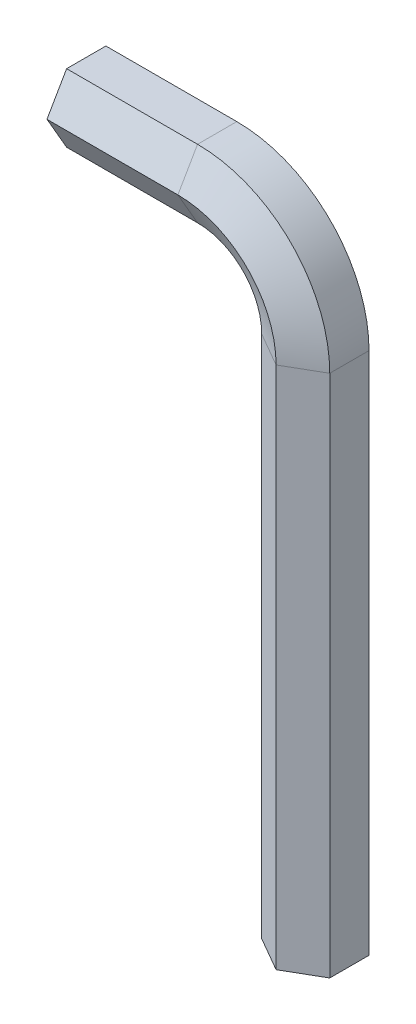
ISO-10303-21;
HEADER;
FILE_DESCRIPTION(('STEP AP214'),'2;1');
FILE_NAME('part.step','',(''),(''),'','','');
FILE_SCHEMA(('AUTOMOTIVE_DESIGN { 1 0 10303 214 1 1 1 1 }'));
ENDSEC;
DATA;
#1=APPLICATION_CONTEXT('core data for automotive mechanical design processes');
#2=APPLICATION_PROTOCOL_DEFINITION('international standard','automotive_design',2000,#1);
#3=PRODUCT_CONTEXT('',#1,'mechanical');
#4=PRODUCT('Part','Part','',(#3));
#5=PRODUCT_RELATED_PRODUCT_CATEGORY('part','',(#4));
#6=PRODUCT_DEFINITION_FORMATION('','',#4);
#7=PRODUCT_DEFINITION_CONTEXT('part definition',#1,'design');
#8=PRODUCT_DEFINITION('design','',#6,#7);
#9=PRODUCT_DEFINITION_SHAPE('','',#8);
#10=(LENGTH_UNIT() NAMED_UNIT(*) SI_UNIT(.MILLI.,.METRE.));
#11=(NAMED_UNIT(*) PLANE_ANGLE_UNIT() SI_UNIT($,.RADIAN.));
#12=(NAMED_UNIT(*) SI_UNIT($,.STERADIAN.) SOLID_ANGLE_UNIT());
#13=UNCERTAINTY_MEASURE_WITH_UNIT(LENGTH_MEASURE(1.E-05),#10,'distance_accuracy_value','');
#14=(GEOMETRIC_REPRESENTATION_CONTEXT(3) GLOBAL_UNCERTAINTY_ASSIGNED_CONTEXT((#13)) GLOBAL_UNIT_ASSIGNED_CONTEXT((#10,
#11,#12)) REPRESENTATION_CONTEXT('',''));
#15=CARTESIAN_POINT('',(0.,0.,0.));
#16=DIRECTION('',(0.,0.,1.));
#17=DIRECTION('',(1.,0.,0.));
#18=AXIS2_PLACEMENT_3D('',#15,#16,#17);
#19=CARTESIAN_POINT('',(-95.,0.,0.));
#20=DIRECTION('',(0.,1.,0.));
#21=DIRECTION('',(0.,0.,1.));
#22=AXIS2_PLACEMENT_3D('',#19,#20,#21);
#23=PLANE('',#22);
#24=DIRECTION('',(0.866025403784439,0.,0.5));
#25=VECTOR('',#24,1.);
#26=CARTESIAN_POINT('',(-5.19615242270663,0.,3.));
#27=LINE('',#26,#25);
#28=CARTESIAN_POINT('',(-5.19615242270663,0.,3.));
#29=VERTEX_POINT('',#28);
#30=CARTESIAN_POINT('',(0.,0.,6.));
#31=VERTEX_POINT('',#30);
#32=EDGE_CURVE('E194',#29,#31,#27,.T.);
#33=ORIENTED_EDGE('',*,*,#32,.F.);
#34=DIRECTION('',(0.,0.,1.));
#35=VECTOR('',#34,1.);
#36=CARTESIAN_POINT('',(-5.19615242270663,0.,-3.));
#37=LINE('',#36,#35);
#38=CARTESIAN_POINT('',(-5.19615242270663,0.,-3.));
#39=VERTEX_POINT('',#38);
#40=EDGE_CURVE('E256',#39,#29,#37,.T.);
#41=ORIENTED_EDGE('',*,*,#40,.F.);
#42=DIRECTION('',(-0.866025403784438,0.,0.5));
#43=VECTOR('',#42,1.);
#44=CARTESIAN_POINT('',(0.,0.,-6.));
#45=LINE('',#44,#43);
#46=CARTESIAN_POINT('',(0.,0.,-6.));
#47=VERTEX_POINT('',#46);
#48=EDGE_CURVE('E236',#47,#39,#45,.T.);
#49=ORIENTED_EDGE('',*,*,#48,.F.);
#50=DIRECTION('',(-0.866025403784438,0.,-0.5));
#51=VECTOR('',#50,1.);
#52=CARTESIAN_POINT('',(5.19615242270663,0.,-3.));
#53=LINE('',#52,#51);
#54=CARTESIAN_POINT('',(5.19615242270663,0.,-3.));
#55=VERTEX_POINT('',#54);
#56=EDGE_CURVE('E141',#55,#47,#53,.T.);
#57=ORIENTED_EDGE('',*,*,#56,.F.);
#58=DIRECTION('',(0.,0.,-1.));
#59=VECTOR('',#58,1.);
#60=CARTESIAN_POINT('',(5.19615242270663,0.,3.));
#61=LINE('',#60,#59);
#62=CARTESIAN_POINT('',(5.19615242270663,0.,3.));
#63=VERTEX_POINT('',#62);
#64=EDGE_CURVE('E145',#63,#55,#61,.T.);
#65=ORIENTED_EDGE('',*,*,#64,.F.);
#66=DIRECTION('',(0.866025403784439,0.,-0.5));
#67=VECTOR('',#66,1.);
#68=CARTESIAN_POINT('',(0.,0.,6.));
#69=LINE('',#68,#67);
#70=EDGE_CURVE('E150',#31,#63,#69,.T.);
#71=ORIENTED_EDGE('',*,*,#70,.F.);
#72=EDGE_LOOP('',(#33,#41,#49,#57,#65,#71));
#73=FACE_BOUND('',#72,.T.);
#74=ADVANCED_FACE('F39',(#73),#23,.F.);
#75=CARTESIAN_POINT('',(-35.,0.,0.));
#76=DIRECTION('',(-1.,0.,0.));
#77=DIRECTION('',(0.,0.,1.));
#78=AXIS2_PLACEMENT_3D('',#75,#76,#77);
#79=PLANE('',#78);
#80=DIRECTION('',(0.,0.866025403784439,0.5));
#81=VECTOR('',#80,1.);
#82=CARTESIAN_POINT('',(-35.,89.8038475772934,3.));
#83=LINE('',#82,#81);
#84=CARTESIAN_POINT('',(-35.,89.8038475772934,3.));
#85=VERTEX_POINT('',#84);
#86=CARTESIAN_POINT('',(-35.,95.,6.));
#87=VERTEX_POINT('',#86);
#88=EDGE_CURVE('E161',#85,#87,#83,.T.);
#89=ORIENTED_EDGE('',*,*,#88,.T.);
#90=DIRECTION('',(0.,0.866025403784439,-0.5));
#91=VECTOR('',#90,1.);
#92=CARTESIAN_POINT('',(-35.,95.,6.));
#93=LINE('',#92,#91);
#94=CARTESIAN_POINT('',(-35.,100.196152422707,3.));
#95=VERTEX_POINT('',#94);
#96=EDGE_CURVE('E164',#87,#95,#93,.T.);
#97=ORIENTED_EDGE('',*,*,#96,.T.);
#98=DIRECTION('',(0.,0.,-1.));
#99=VECTOR('',#98,1.);
#100=CARTESIAN_POINT('',(-35.,100.196152422707,3.));
#101=LINE('',#100,#99);
#102=CARTESIAN_POINT('',(-35.,100.196152422707,-3.));
#103=VERTEX_POINT('',#102);
#104=EDGE_CURVE('E214',#95,#103,#101,.T.);
#105=ORIENTED_EDGE('',*,*,#104,.T.);
#106=DIRECTION('',(0.,-0.866025403784438,-0.5));
#107=VECTOR('',#106,1.);
#108=CARTESIAN_POINT('',(-35.,100.196152422707,-3.));
#109=LINE('',#108,#107);
#110=CARTESIAN_POINT('',(-35.,95.,-6.));
#111=VERTEX_POINT('',#110);
#112=EDGE_CURVE('E59',#103,#111,#109,.T.);
#113=ORIENTED_EDGE('',*,*,#112,.T.);
#114=DIRECTION('',(0.,-0.866025403784438,0.5));
#115=VECTOR('',#114,1.);
#116=CARTESIAN_POINT('',(-35.,95.,-6.));
#117=LINE('',#116,#115);
#118=CARTESIAN_POINT('',(-35.,89.8038475772934,-3.));
#119=VERTEX_POINT('',#118);
#120=EDGE_CURVE('E53',#111,#119,#117,.T.);
#121=ORIENTED_EDGE('',*,*,#120,.T.);
#122=DIRECTION('',(0.,0.,1.));
#123=VECTOR('',#122,1.);
#124=CARTESIAN_POINT('',(-35.,89.8038475772934,-3.));
#125=LINE('',#124,#123);
#126=EDGE_CURVE('E11',#119,#85,#125,.T.);
#127=ORIENTED_EDGE('',*,*,#126,.T.);
#128=EDGE_LOOP('',(#89,#97,#105,#113,#121,#127));
#129=FACE_BOUND('',#128,.T.);
#130=ADVANCED_FACE('F163',(#129),#79,.T.);
#131=CARTESIAN_POINT('',(-5.19615242270663,0.,3.));
#132=DIRECTION('',(-0.5,0.,0.866025403784439));
#133=DIRECTION('',(0.866025403784439,0.,0.5));
#134=AXIS2_PLACEMENT_3D('',#131,#132,#133);
#135=PLANE('',#134);
#136=DIRECTION('',(0.,1.,0.));
#137=VECTOR('',#136,1.);
#138=CARTESIAN_POINT('',(0.,0.,6.));
#139=LINE('',#138,#137);
#140=CARTESIAN_POINT('',(0.,80.,6.));
#141=VERTEX_POINT('',#140);
#142=EDGE_CURVE('E200',#31,#141,#139,.T.);
#143=ORIENTED_EDGE('',*,*,#142,.T.);
#144=DIRECTION('',(0.866025403784439,0.,0.5));
#145=VECTOR('',#144,1.);
#146=CARTESIAN_POINT('',(-5.19615242270663,80.,3.));
#147=LINE('',#146,#145);
#148=CARTESIAN_POINT('',(-5.19615242270663,80.,3.));
#149=VERTEX_POINT('',#148);
#150=EDGE_CURVE('E301',#149,#141,#147,.T.);
#151=ORIENTED_EDGE('',*,*,#150,.F.);
#152=DIRECTION('',(0.,1.,0.));
#153=VECTOR('',#152,1.);
#154=CARTESIAN_POINT('',(-5.19615242270663,0.,3.));
#155=LINE('',#154,#153);
#156=EDGE_CURVE('E277',#29,#149,#155,.T.);
#157=ORIENTED_EDGE('',*,*,#156,.F.);
#158=ORIENTED_EDGE('',*,*,#32,.T.);
#159=EDGE_LOOP('',(#143,#151,#157,#158));
#160=FACE_BOUND('',#159,.T.);
#161=ADVANCED_FACE('F311',(#160),#135,.T.);
#162=CARTESIAN_POINT('',(0.,0.,6.));
#163=DIRECTION('',(0.5,0.,0.866025403784438));
#164=DIRECTION('',(0.866025403784438,0.,-0.5));
#165=AXIS2_PLACEMENT_3D('',#162,#163,#164);
#166=PLANE('',#165);
#167=DIRECTION('',(0.,1.,0.));
#168=VECTOR('',#167,1.);
#169=CARTESIAN_POINT('',(5.19615242270663,0.,3.));
#170=LINE('',#169,#168);
#171=CARTESIAN_POINT('',(5.19615242270663,80.,3.));
#172=VERTEX_POINT('',#171);
#173=EDGE_CURVE('E199',#63,#172,#170,.T.);
#174=ORIENTED_EDGE('',*,*,#173,.T.);
#175=DIRECTION('',(0.866025403784439,0.,-0.5));
#176=VECTOR('',#175,1.);
#177=CARTESIAN_POINT('',(0.,80.,6.));
#178=LINE('',#177,#176);
#179=EDGE_CURVE('E195',#141,#172,#178,.T.);
#180=ORIENTED_EDGE('',*,*,#179,.F.);
#181=ORIENTED_EDGE('',*,*,#142,.F.);
#182=ORIENTED_EDGE('',*,*,#70,.T.);
#183=EDGE_LOOP('',(#174,#180,#181,#182));
#184=FACE_BOUND('',#183,.T.);
#185=ADVANCED_FACE('F314',(#184),#166,.T.);
#186=CARTESIAN_POINT('',(5.19615242270663,0.,3.));
#187=DIRECTION('',(1.,0.,0.));
#188=DIRECTION('',(0.,0.,-1.));
#189=AXIS2_PLACEMENT_3D('',#186,#187,#188);
#190=PLANE('',#189);
#191=DIRECTION('',(0.,1.,0.));
#192=VECTOR('',#191,1.);
#193=CARTESIAN_POINT('',(5.19615242270663,0.,-3.));
#194=LINE('',#193,#192);
#195=CARTESIAN_POINT('',(5.19615242270663,80.,-3.));
#196=VERTEX_POINT('',#195);
#197=EDGE_CURVE('E219',#55,#196,#194,.T.);
#198=ORIENTED_EDGE('',*,*,#197,.T.);
#199=DIRECTION('',(0.,0.,-1.));
#200=VECTOR('',#199,1.);
#201=CARTESIAN_POINT('',(5.19615242270663,80.,3.));
#202=LINE('',#201,#200);
#203=EDGE_CURVE('E204',#172,#196,#202,.T.);
#204=ORIENTED_EDGE('',*,*,#203,.F.);
#205=ORIENTED_EDGE('',*,*,#173,.F.);
#206=ORIENTED_EDGE('',*,*,#64,.T.);
#207=EDGE_LOOP('',(#198,#204,#205,#206));
#208=FACE_BOUND('',#207,.T.);
#209=ADVANCED_FACE('F368',(#208),#190,.T.);
#210=CARTESIAN_POINT('',(5.19615242270663,0.,-3.));
#211=DIRECTION('',(0.5,0.,-0.866025403784438));
#212=DIRECTION('',(-0.866025403784438,0.,-0.5));
#213=AXIS2_PLACEMENT_3D('',#210,#211,#212);
#214=PLANE('',#213);
#215=DIRECTION('',(0.,1.,0.));
#216=VECTOR('',#215,1.);
#217=CARTESIAN_POINT('',(0.,0.,-6.));
#218=LINE('',#217,#216);
#219=CARTESIAN_POINT('',(0.,80.,-6.));
#220=VERTEX_POINT('',#219);
#221=EDGE_CURVE('E239',#47,#220,#218,.T.);
#222=ORIENTED_EDGE('',*,*,#221,.T.);
#223=DIRECTION('',(-0.866025403784438,0.,-0.5));
#224=VECTOR('',#223,1.);
#225=CARTESIAN_POINT('',(5.19615242270663,80.,-3.));
#226=LINE('',#225,#224);
#227=EDGE_CURVE('E223',#196,#220,#226,.T.);
#228=ORIENTED_EDGE('',*,*,#227,.F.);
#229=ORIENTED_EDGE('',*,*,#197,.F.);
#230=ORIENTED_EDGE('',*,*,#56,.T.);
#231=EDGE_LOOP('',(#222,#228,#229,#230));
#232=FACE_BOUND('',#231,.T.);
#233=ADVANCED_FACE('F376',(#232),#214,.T.);
#234=CARTESIAN_POINT('',(0.,0.,-6.));
#235=DIRECTION('',(-0.5,0.,-0.866025403784438));
#236=DIRECTION('',(-0.866025403784438,0.,0.5));
#237=AXIS2_PLACEMENT_3D('',#234,#235,#236);
#238=PLANE('',#237);
#239=DIRECTION('',(0.,1.,0.));
#240=VECTOR('',#239,1.);
#241=CARTESIAN_POINT('',(-5.19615242270663,0.,-3.));
#242=LINE('',#241,#240);
#243=CARTESIAN_POINT('',(-5.19615242270663,80.,-3.));
#244=VERTEX_POINT('',#243);
#245=EDGE_CURVE('E259',#39,#244,#242,.T.);
#246=ORIENTED_EDGE('',*,*,#245,.T.);
#247=DIRECTION('',(-0.866025403784438,0.,0.5));
#248=VECTOR('',#247,1.);
#249=CARTESIAN_POINT('',(0.,80.,-6.));
#250=LINE('',#249,#248);
#251=EDGE_CURVE('E243',#220,#244,#250,.T.);
#252=ORIENTED_EDGE('',*,*,#251,.F.);
#253=ORIENTED_EDGE('',*,*,#221,.F.);
#254=ORIENTED_EDGE('',*,*,#48,.T.);
#255=EDGE_LOOP('',(#246,#252,#253,#254));
#256=FACE_BOUND('',#255,.T.);
#257=ADVANCED_FACE('F386',(#256),#238,.T.);
#258=CARTESIAN_POINT('',(-5.19615242270663,0.,-3.));
#259=DIRECTION('',(-1.,0.,0.));
#260=DIRECTION('',(0.,0.,1.));
#261=AXIS2_PLACEMENT_3D('',#258,#259,#260);
#262=PLANE('',#261);
#263=DIRECTION('',(0.,0.,1.));
#264=VECTOR('',#263,1.);
#265=CARTESIAN_POINT('',(-5.19615242270663,80.,-3.));
#266=LINE('',#265,#264);
#267=EDGE_CURVE('E263',#244,#149,#266,.T.);
#268=ORIENTED_EDGE('',*,*,#267,.F.);
#269=ORIENTED_EDGE('',*,*,#245,.F.);
#270=ORIENTED_EDGE('',*,*,#40,.T.);
#271=ORIENTED_EDGE('',*,*,#156,.T.);
#272=EDGE_LOOP('',(#268,#269,#270,#271));
#273=FACE_BOUND('',#272,.T.);
#274=ADVANCED_FACE('F327',(#273),#262,.T.);
#275=CARTESIAN_POINT('',(-15.,80.,3.));
#276=DIRECTION('',(0.,0.,1.));
#277=DIRECTION('',(1.,0.,0.));
#278=AXIS2_PLACEMENT_3D('',#275,#276,#277);
#279=CONICAL_SURFACE('',#278,9.80384757729337,1.0471975511966);
#280=CARTESIAN_POINT('',(-15.,80.,6.));
#281=DIRECTION('',(0.,0.,1.));
#282=DIRECTION('',(1.,0.,0.));
#283=AXIS2_PLACEMENT_3D('',#280,#281,#282);
#284=CIRCLE('',#283,15.);
#285=CARTESIAN_POINT('',(-14.9999999999999,95.,6.));
#286=VERTEX_POINT('',#285);
#287=EDGE_CURVE('E208',#141,#286,#284,.T.);
#288=ORIENTED_EDGE('',*,*,#287,.T.);
#289=DIRECTION('',(0.,0.866025403784439,0.5));
#290=VECTOR('',#289,1.);
#291=CARTESIAN_POINT('',(-14.9999999999999,89.8038475772934,3.));
#292=LINE('',#291,#290);
#293=CARTESIAN_POINT('',(-14.9999999999999,89.8038475772934,3.));
#294=VERTEX_POINT('',#293);
#295=EDGE_CURVE('E184',#294,#286,#292,.T.);
#296=ORIENTED_EDGE('',*,*,#295,.F.);
#297=CARTESIAN_POINT('',(-15.,80.,3.));
#298=DIRECTION('',(0.,0.,1.));
#299=DIRECTION('',(1.,0.,0.));
#300=AXIS2_PLACEMENT_3D('',#297,#298,#299);
#301=CIRCLE('',#300,9.80384757729337);
#302=EDGE_CURVE('E280',#149,#294,#301,.T.);
#303=ORIENTED_EDGE('',*,*,#302,.F.);
#304=ORIENTED_EDGE('',*,*,#150,.T.);
#305=EDGE_LOOP('',(#288,#296,#303,#304));
#306=FACE_BOUND('',#305,.T.);
#307=ADVANCED_FACE('F287',(#306),#279,.F.);
#308=CARTESIAN_POINT('',(-15.,80.,6.));
#309=DIRECTION('',(0.,0.,-1.));
#310=DIRECTION('',(-1.,0.,0.));
#311=AXIS2_PLACEMENT_3D('',#308,#309,#310);
#312=CONICAL_SURFACE('',#311,15.,1.0471975511966);
#313=CARTESIAN_POINT('',(-15.,80.,3.));
#314=DIRECTION('',(0.,0.,1.));
#315=DIRECTION('',(1.,0.,0.));
#316=AXIS2_PLACEMENT_3D('',#313,#314,#315);
#317=CIRCLE('',#316,20.1961524227066);
#318=CARTESIAN_POINT('',(-14.9999999999999,100.196152422707,3.));
#319=VERTEX_POINT('',#318);
#320=EDGE_CURVE('E128',#172,#319,#317,.T.);
#321=ORIENTED_EDGE('',*,*,#320,.T.);
#322=DIRECTION('',(0.,0.866025403784439,-0.5));
#323=VECTOR('',#322,1.);
#324=CARTESIAN_POINT('',(-14.9999999999999,95.,6.));
#325=LINE('',#324,#323);
#326=EDGE_CURVE('E205',#286,#319,#325,.T.);
#327=ORIENTED_EDGE('',*,*,#326,.F.);
#328=ORIENTED_EDGE('',*,*,#287,.F.);
#329=ORIENTED_EDGE('',*,*,#179,.T.);
#330=EDGE_LOOP('',(#321,#327,#328,#329));
#331=FACE_BOUND('',#330,.T.);
#332=ADVANCED_FACE('F317',(#331),#312,.T.);
#333=CARTESIAN_POINT('',(-15.,80.,0.));
#334=DIRECTION('',(0.,0.,1.));
#335=DIRECTION('',(1.,0.,0.));
#336=AXIS2_PLACEMENT_3D('',#333,#334,#335);
#337=CYLINDRICAL_SURFACE('',#336,20.1961524227066);
#338=CARTESIAN_POINT('',(-15.,80.,-3.));
#339=DIRECTION('',(0.,0.,1.));
#340=DIRECTION('',(1.,0.,0.));
#341=AXIS2_PLACEMENT_3D('',#338,#339,#340);
#342=CIRCLE('',#341,20.1961524227066);
#343=CARTESIAN_POINT('',(-14.9999999999999,100.196152422707,-3.));
#344=VERTEX_POINT('',#343);
#345=EDGE_CURVE('E119',#196,#344,#342,.T.);
#346=ORIENTED_EDGE('',*,*,#345,.T.);
#347=DIRECTION('',(0.,0.,-1.));
#348=VECTOR('',#347,1.);
#349=CARTESIAN_POINT('',(-14.9999999999999,100.196152422707,3.));
#350=LINE('',#349,#348);
#351=EDGE_CURVE('E210',#319,#344,#350,.T.);
#352=ORIENTED_EDGE('',*,*,#351,.F.);
#353=ORIENTED_EDGE('',*,*,#320,.F.);
#354=ORIENTED_EDGE('',*,*,#203,.T.);
#355=EDGE_LOOP('',(#346,#352,#353,#354));
#356=FACE_BOUND('',#355,.T.);
#357=ADVANCED_FACE('F319',(#356),#337,.T.);
#358=CARTESIAN_POINT('',(-15.,80.,-3.));
#359=DIRECTION('',(0.,0.,1.));
#360=DIRECTION('',(1.,0.,0.));
#361=AXIS2_PLACEMENT_3D('',#358,#359,#360);
#362=CONICAL_SURFACE('',#361,20.1961524227066,1.0471975511966);
#363=CARTESIAN_POINT('',(-15.,80.,-6.));
#364=DIRECTION('',(0.,0.,1.));
#365=DIRECTION('',(1.,0.,0.));
#366=AXIS2_PLACEMENT_3D('',#363,#364,#365);
#367=CIRCLE('',#366,15.);
#368=CARTESIAN_POINT('',(-14.9999999999999,95.,-6.));
#369=VERTEX_POINT('',#368);
#370=EDGE_CURVE('E112',#220,#369,#367,.T.);
#371=ORIENTED_EDGE('',*,*,#370,.T.);
#372=DIRECTION('',(0.,-0.866025403784438,-0.5));
#373=VECTOR('',#372,1.);
#374=CARTESIAN_POINT('',(-14.9999999999999,100.196152422707,-3.));
#375=LINE('',#374,#373);
#376=EDGE_CURVE('E229',#344,#369,#375,.T.);
#377=ORIENTED_EDGE('',*,*,#376,.F.);
#378=ORIENTED_EDGE('',*,*,#345,.F.);
#379=ORIENTED_EDGE('',*,*,#227,.T.);
#380=EDGE_LOOP('',(#371,#377,#378,#379));
#381=FACE_BOUND('',#380,.T.);
#382=ADVANCED_FACE('F325',(#381),#362,.T.);
#383=CARTESIAN_POINT('',(-15.,80.,-6.));
#384=DIRECTION('',(0.,0.,-1.));
#385=DIRECTION('',(-1.,0.,0.));
#386=AXIS2_PLACEMENT_3D('',#383,#384,#385);
#387=CONICAL_SURFACE('',#386,15.,1.0471975511966);
#388=CARTESIAN_POINT('',(-15.,80.,-3.));
#389=DIRECTION('',(0.,0.,1.));
#390=DIRECTION('',(1.,0.,0.));
#391=AXIS2_PLACEMENT_3D('',#388,#389,#390);
#392=CIRCLE('',#391,9.80384757729337);
#393=CARTESIAN_POINT('',(-14.9999999999999,89.8038475772934,-3.));
#394=VERTEX_POINT('',#393);
#395=EDGE_CURVE('E266',#244,#394,#392,.T.);
#396=ORIENTED_EDGE('',*,*,#395,.T.);
#397=DIRECTION('',(0.,-0.866025403784438,0.5));
#398=VECTOR('',#397,1.);
#399=CARTESIAN_POINT('',(-14.9999999999999,95.,-6.));
#400=LINE('',#399,#398);
#401=EDGE_CURVE('E248',#369,#394,#400,.T.);
#402=ORIENTED_EDGE('',*,*,#401,.F.);
#403=ORIENTED_EDGE('',*,*,#370,.F.);
#404=ORIENTED_EDGE('',*,*,#251,.T.);
#405=EDGE_LOOP('',(#396,#402,#403,#404));
#406=FACE_BOUND('',#405,.T.);
#407=ADVANCED_FACE('F429',(#406),#387,.F.);
#408=CARTESIAN_POINT('',(-15.,80.,0.));
#409=DIRECTION('',(0.,0.,1.));
#410=DIRECTION('',(1.,0.,0.));
#411=AXIS2_PLACEMENT_3D('',#408,#409,#410);
#412=CYLINDRICAL_SURFACE('',#411,9.80384757729337);
#413=DIRECTION('',(0.,0.,1.));
#414=VECTOR('',#413,1.);
#415=CARTESIAN_POINT('',(-14.9999999999999,89.8038475772934,-3.));
#416=LINE('',#415,#414);
#417=EDGE_CURVE('E191',#394,#294,#416,.T.);
#418=ORIENTED_EDGE('',*,*,#417,.F.);
#419=ORIENTED_EDGE('',*,*,#395,.F.);
#420=ORIENTED_EDGE('',*,*,#267,.T.);
#421=ORIENTED_EDGE('',*,*,#302,.T.);
#422=EDGE_LOOP('',(#418,#419,#420,#421));
#423=FACE_BOUND('',#422,.T.);
#424=ADVANCED_FACE('F291',(#423),#412,.F.);
#425=CARTESIAN_POINT('',(-15.,89.8038475772934,3.));
#426=DIRECTION('',(0.,-0.5,0.866025403784439));
#427=DIRECTION('',(0.,-0.866025403784439,-0.5));
#428=AXIS2_PLACEMENT_3D('',#425,#426,#427);
#429=PLANE('',#428);
#430=DIRECTION('',(-1.,0.,0.));
#431=VECTOR('',#430,1.);
#432=CARTESIAN_POINT('',(-15.,95.,6.));
#433=LINE('',#432,#431);
#434=EDGE_CURVE('E170',#286,#87,#433,.T.);
#435=ORIENTED_EDGE('',*,*,#434,.T.);
#436=ORIENTED_EDGE('',*,*,#88,.F.);
#437=DIRECTION('',(-1.,0.,0.));
#438=VECTOR('',#437,1.);
#439=CARTESIAN_POINT('',(-15.,89.8038475772934,3.));
#440=LINE('',#439,#438);
#441=EDGE_CURVE('E171',#294,#85,#440,.T.);
#442=ORIENTED_EDGE('',*,*,#441,.F.);
#443=ORIENTED_EDGE('',*,*,#295,.T.);
#444=EDGE_LOOP('',(#435,#436,#442,#443));
#445=FACE_BOUND('',#444,.T.);
#446=ADVANCED_FACE('F182',(#445),#429,.T.);
#447=CARTESIAN_POINT('',(-15.,95.,6.));
#448=DIRECTION('',(0.,0.5,0.866025403784438));
#449=DIRECTION('',(0.,-0.866025403784439,0.5));
#450=AXIS2_PLACEMENT_3D('',#447,#448,#449);
#451=PLANE('',#450);
#452=DIRECTION('',(-1.,0.,0.));
#453=VECTOR('',#452,1.);
#454=CARTESIAN_POINT('',(-15.,100.196152422707,3.));
#455=LINE('',#454,#453);
#456=EDGE_CURVE('E178',#319,#95,#455,.T.);
#457=ORIENTED_EDGE('',*,*,#456,.T.);
#458=ORIENTED_EDGE('',*,*,#96,.F.);
#459=ORIENTED_EDGE('',*,*,#434,.F.);
#460=ORIENTED_EDGE('',*,*,#326,.T.);
#461=EDGE_LOOP('',(#457,#458,#459,#460));
#462=FACE_BOUND('',#461,.T.);
#463=ADVANCED_FACE('F175',(#462),#451,.T.);
#464=CARTESIAN_POINT('',(-15.,100.196152422707,3.));
#465=DIRECTION('',(0.,1.,0.));
#466=DIRECTION('',(0.,0.,1.));
#467=AXIS2_PLACEMENT_3D('',#464,#465,#466);
#468=PLANE('',#467);
#469=DIRECTION('',(-1.,0.,0.));
#470=VECTOR('',#469,1.);
#471=CARTESIAN_POINT('',(-15.,100.196152422707,-3.));
#472=LINE('',#471,#470);
#473=EDGE_CURVE('E97',#344,#103,#472,.T.);
#474=ORIENTED_EDGE('',*,*,#473,.T.);
#475=ORIENTED_EDGE('',*,*,#104,.F.);
#476=ORIENTED_EDGE('',*,*,#456,.F.);
#477=ORIENTED_EDGE('',*,*,#351,.T.);
#478=EDGE_LOOP('',(#474,#475,#476,#477));
#479=FACE_BOUND('',#478,.T.);
#480=ADVANCED_FACE('F461',(#479),#468,.T.);
#481=CARTESIAN_POINT('',(-15.,100.196152422707,-3.));
#482=DIRECTION('',(0.,0.5,-0.866025403784438));
#483=DIRECTION('',(0.,0.866025403784439,0.5));
#484=AXIS2_PLACEMENT_3D('',#481,#482,#483);
#485=PLANE('',#484);
#486=DIRECTION('',(-1.,0.,0.));
#487=VECTOR('',#486,1.);
#488=CARTESIAN_POINT('',(-15.,95.,-6.));
#489=LINE('',#488,#487);
#490=EDGE_CURVE('E89',#369,#111,#489,.T.);
#491=ORIENTED_EDGE('',*,*,#490,.T.);
#492=ORIENTED_EDGE('',*,*,#112,.F.);
#493=ORIENTED_EDGE('',*,*,#473,.F.);
#494=ORIENTED_EDGE('',*,*,#376,.T.);
#495=EDGE_LOOP('',(#491,#492,#493,#494));
#496=FACE_BOUND('',#495,.T.);
#497=ADVANCED_FACE('F337',(#496),#485,.T.);
#498=CARTESIAN_POINT('',(-15.,95.,-6.));
#499=DIRECTION('',(0.,-0.5,-0.866025403784438));
#500=DIRECTION('',(0.,0.866025403784438,-0.5));
#501=AXIS2_PLACEMENT_3D('',#498,#499,#500);
#502=PLANE('',#501);
#503=DIRECTION('',(-1.,0.,0.));
#504=VECTOR('',#503,1.);
#505=CARTESIAN_POINT('',(-15.,89.8038475772934,-3.));
#506=LINE('',#505,#504);
#507=EDGE_CURVE('E47',#394,#119,#506,.T.);
#508=ORIENTED_EDGE('',*,*,#507,.T.);
#509=ORIENTED_EDGE('',*,*,#120,.F.);
#510=ORIENTED_EDGE('',*,*,#490,.F.);
#511=ORIENTED_EDGE('',*,*,#401,.T.);
#512=EDGE_LOOP('',(#508,#509,#510,#511));
#513=FACE_BOUND('',#512,.T.);
#514=ADVANCED_FACE('F332',(#513),#502,.T.);
#515=CARTESIAN_POINT('',(-15.,89.8038475772934,-3.));
#516=DIRECTION('',(0.,-1.,0.));
#517=DIRECTION('',(0.,0.,-1.));
#518=AXIS2_PLACEMENT_3D('',#515,#516,#517);
#519=PLANE('',#518);
#520=ORIENTED_EDGE('',*,*,#126,.F.);
#521=ORIENTED_EDGE('',*,*,#507,.F.);
#522=ORIENTED_EDGE('',*,*,#417,.T.);
#523=ORIENTED_EDGE('',*,*,#441,.T.);
#524=EDGE_LOOP('',(#520,#521,#522,#523));
#525=FACE_BOUND('',#524,.T.);
#526=ADVANCED_FACE('F282',(#525),#519,.T.);
#527=CLOSED_SHELL('',(#74,#130,#161,#185,#209,#233,#257,#274,#307,#332,#357,#382,#407,#424,#446,
#463,#480,#497,#514,#526));
#528=MANIFOLD_SOLID_BREP('B2',#527);
#529=ADVANCED_BREP_SHAPE_REPRESENTATION('',(#18,#528),#14);
#530=SHAPE_DEFINITION_REPRESENTATION(#9,#529);
ENDSEC;
END-ISO-10303-21;
